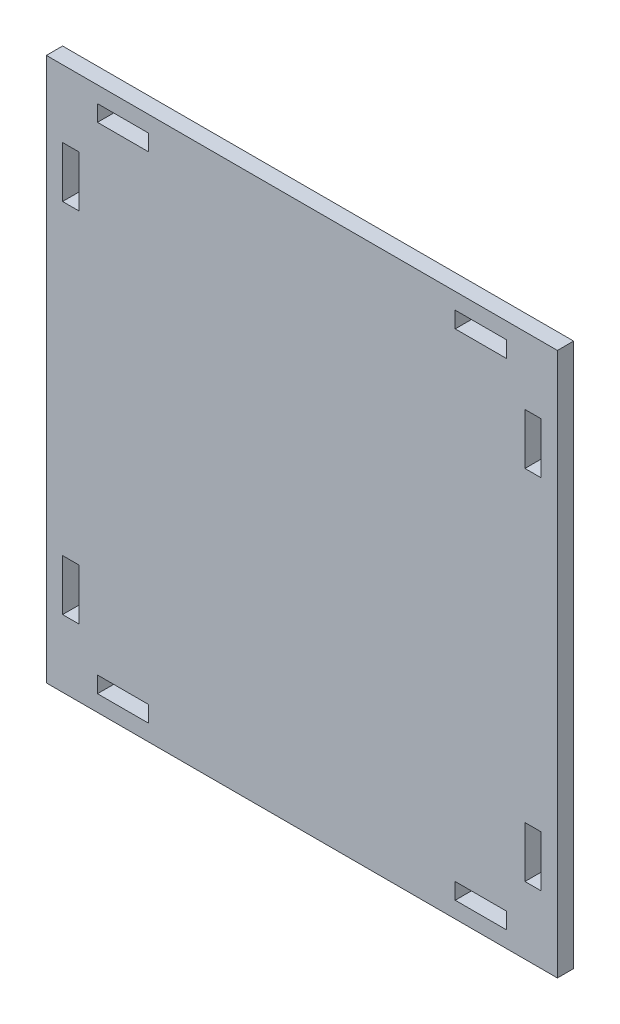
ISO-10303-21;
HEADER;
FILE_DESCRIPTION(('STEP AP214'),'2;1');
FILE_NAME('part.step','',(''),(''),'','','');
FILE_SCHEMA(('AUTOMOTIVE_DESIGN { 1 0 10303 214 1 1 1 1 }'));
ENDSEC;
DATA;
#1=APPLICATION_CONTEXT('core data for automotive mechanical design processes');
#2=APPLICATION_PROTOCOL_DEFINITION('international standard','automotive_design',2000,#1);
#3=PRODUCT_CONTEXT('',#1,'mechanical');
#4=PRODUCT('Part','Part','',(#3));
#5=PRODUCT_RELATED_PRODUCT_CATEGORY('part','',(#4));
#6=PRODUCT_DEFINITION_FORMATION('','',#4);
#7=PRODUCT_DEFINITION_CONTEXT('part definition',#1,'design');
#8=PRODUCT_DEFINITION('design','',#6,#7);
#9=PRODUCT_DEFINITION_SHAPE('','',#8);
#10=(LENGTH_UNIT() NAMED_UNIT(*) SI_UNIT(.MILLI.,.METRE.));
#11=(NAMED_UNIT(*) PLANE_ANGLE_UNIT() SI_UNIT($,.RADIAN.));
#12=(NAMED_UNIT(*) SI_UNIT($,.STERADIAN.) SOLID_ANGLE_UNIT());
#13=UNCERTAINTY_MEASURE_WITH_UNIT(LENGTH_MEASURE(1.E-05),#10,'distance_accuracy_value','');
#14=(GEOMETRIC_REPRESENTATION_CONTEXT(3) GLOBAL_UNCERTAINTY_ASSIGNED_CONTEXT((#13)) GLOBAL_UNIT_ASSIGNED_CONTEXT((#10,
#11,#12)) REPRESENTATION_CONTEXT('',''));
#15=CARTESIAN_POINT('',(0.,0.,0.));
#16=DIRECTION('',(0.,0.,1.));
#17=DIRECTION('',(1.,0.,0.));
#18=AXIS2_PLACEMENT_3D('',#15,#16,#17);
#19=CARTESIAN_POINT('',(0.,0.,3.175));
#20=DIRECTION('',(0.,0.,-1.));
#21=DIRECTION('',(-1.,0.,0.));
#22=AXIS2_PLACEMENT_3D('',#19,#20,#21);
#23=PLANE('',#22);
#24=DIRECTION('',(1.,0.,0.));
#25=VECTOR('',#24,1.);
#26=CARTESIAN_POINT('',(10.,3.175,3.175));
#27=LINE('',#26,#25);
#28=CARTESIAN_POINT('',(10.,3.175,3.175));
#29=VERTEX_POINT('',#28);
#30=CARTESIAN_POINT('',(20.,3.175,3.175));
#31=VERTEX_POINT('',#30);
#32=EDGE_CURVE('E302',#29,#31,#27,.T.);
#33=ORIENTED_EDGE('',*,*,#32,.F.);
#34=DIRECTION('',(0.,-1.,0.));
#35=VECTOR('',#34,1.);
#36=CARTESIAN_POINT('',(10.,3.175,3.175));
#37=LINE('',#36,#35);
#38=CARTESIAN_POINT('',(10.,6.34999999999999,3.175));
#39=VERTEX_POINT('',#38);
#40=EDGE_CURVE('E310',#39,#29,#37,.T.);
#41=ORIENTED_EDGE('',*,*,#40,.F.);
#42=DIRECTION('',(-1.,0.,0.));
#43=VECTOR('',#42,1.);
#44=CARTESIAN_POINT('',(10.,6.34999999999999,3.175));
#45=LINE('',#44,#43);
#46=CARTESIAN_POINT('',(20.,6.34999999999999,3.175));
#47=VERTEX_POINT('',#46);
#48=EDGE_CURVE('E307',#47,#39,#45,.T.);
#49=ORIENTED_EDGE('',*,*,#48,.F.);
#50=DIRECTION('',(0.,1.,0.));
#51=VECTOR('',#50,1.);
#52=CARTESIAN_POINT('',(20.,3.175,3.175));
#53=LINE('',#52,#51);
#54=EDGE_CURVE('E304',#31,#47,#53,.T.);
#55=ORIENTED_EDGE('',*,*,#54,.F.);
#56=EDGE_LOOP('',(#33,#41,#49,#55));
#57=FACE_BOUND('',#56,.T.);
#58=DIRECTION('',(0.,1.,0.));
#59=VECTOR('',#58,1.);
#60=CARTESIAN_POINT('',(96.825,23.175,3.175));
#61=LINE('',#60,#59);
#62=CARTESIAN_POINT('',(96.825,13.175,3.175));
#63=VERTEX_POINT('',#62);
#64=CARTESIAN_POINT('',(96.825,23.175,3.175));
#65=VERTEX_POINT('',#64);
#66=EDGE_CURVE('E364',#63,#65,#61,.T.);
#67=ORIENTED_EDGE('',*,*,#66,.F.);
#68=DIRECTION('',(1.,0.,0.));
#69=VECTOR('',#68,1.);
#70=CARTESIAN_POINT('',(96.825,13.175,3.175));
#71=LINE('',#70,#69);
#72=CARTESIAN_POINT('',(93.65,13.175,3.175));
#73=VERTEX_POINT('',#72);
#74=EDGE_CURVE('E372',#73,#63,#71,.T.);
#75=ORIENTED_EDGE('',*,*,#74,.F.);
#76=DIRECTION('',(0.,-1.,0.));
#77=VECTOR('',#76,1.);
#78=CARTESIAN_POINT('',(93.65,23.175,3.175));
#79=LINE('',#78,#77);
#80=CARTESIAN_POINT('',(93.65,23.175,3.175));
#81=VERTEX_POINT('',#80);
#82=EDGE_CURVE('E369',#81,#73,#79,.T.);
#83=ORIENTED_EDGE('',*,*,#82,.F.);
#84=DIRECTION('',(-1.,0.,0.));
#85=VECTOR('',#84,1.);
#86=CARTESIAN_POINT('',(96.825,23.175,3.175));
#87=LINE('',#86,#85);
#88=EDGE_CURVE('E366',#65,#81,#87,.T.);
#89=ORIENTED_EDGE('',*,*,#88,.F.);
#90=EDGE_LOOP('',(#67,#75,#83,#89));
#91=FACE_BOUND('',#90,.T.);
#92=DIRECTION('',(-1.,0.,0.));
#93=VECTOR('',#92,1.);
#94=CARTESIAN_POINT('',(90.,103.175,3.175));
#95=LINE('',#94,#93);
#96=CARTESIAN_POINT('',(90.,103.175,3.175));
#97=VERTEX_POINT('',#96);
#98=CARTESIAN_POINT('',(80.,103.175,3.175));
#99=VERTEX_POINT('',#98);
#100=EDGE_CURVE('E426',#97,#99,#95,.T.);
#101=ORIENTED_EDGE('',*,*,#100,.F.);
#102=DIRECTION('',(0.,1.,0.));
#103=VECTOR('',#102,1.);
#104=CARTESIAN_POINT('',(90.,103.175,3.175));
#105=LINE('',#104,#103);
#106=CARTESIAN_POINT('',(90.,100.,3.175));
#107=VERTEX_POINT('',#106);
#108=EDGE_CURVE('E434',#107,#97,#105,.T.);
#109=ORIENTED_EDGE('',*,*,#108,.F.);
#110=DIRECTION('',(1.,0.,0.));
#111=VECTOR('',#110,1.);
#112=CARTESIAN_POINT('',(90.,100.,3.175));
#113=LINE('',#112,#111);
#114=CARTESIAN_POINT('',(80.,100.,3.175));
#115=VERTEX_POINT('',#114);
#116=EDGE_CURVE('E431',#115,#107,#113,.T.);
#117=ORIENTED_EDGE('',*,*,#116,.F.);
#118=DIRECTION('',(0.,-1.,0.));
#119=VECTOR('',#118,1.);
#120=CARTESIAN_POINT('',(80.,103.175,3.175));
#121=LINE('',#120,#119);
#122=EDGE_CURVE('E428',#99,#115,#121,.T.);
#123=ORIENTED_EDGE('',*,*,#122,.F.);
#124=EDGE_LOOP('',(#101,#109,#117,#123));
#125=FACE_BOUND('',#124,.T.);
#126=DIRECTION('',(0.,-1.,0.));
#127=VECTOR('',#126,1.);
#128=CARTESIAN_POINT('',(3.175,83.175,3.175));
#129=LINE('',#128,#127);
#130=CARTESIAN_POINT('',(3.175,93.175,3.175));
#131=VERTEX_POINT('',#130);
#132=CARTESIAN_POINT('',(3.175,83.175,3.175));
#133=VERTEX_POINT('',#132);
#134=EDGE_CURVE('E488',#131,#133,#129,.T.);
#135=ORIENTED_EDGE('',*,*,#134,.F.);
#136=DIRECTION('',(-1.,0.,0.));
#137=VECTOR('',#136,1.);
#138=CARTESIAN_POINT('',(3.175,93.175,3.175));
#139=LINE('',#138,#137);
#140=CARTESIAN_POINT('',(6.35,93.175,3.175));
#141=VERTEX_POINT('',#140);
#142=EDGE_CURVE('E496',#141,#131,#139,.T.);
#143=ORIENTED_EDGE('',*,*,#142,.F.);
#144=DIRECTION('',(0.,1.,0.));
#145=VECTOR('',#144,1.);
#146=CARTESIAN_POINT('',(6.35,83.175,3.175));
#147=LINE('',#146,#145);
#148=CARTESIAN_POINT('',(6.35,83.175,3.175));
#149=VERTEX_POINT('',#148);
#150=EDGE_CURVE('E493',#149,#141,#147,.T.);
#151=ORIENTED_EDGE('',*,*,#150,.F.);
#152=DIRECTION('',(1.,0.,0.));
#153=VECTOR('',#152,1.);
#154=CARTESIAN_POINT('',(3.175,83.175,3.175));
#155=LINE('',#154,#153);
#156=EDGE_CURVE('E490',#133,#149,#155,.T.);
#157=ORIENTED_EDGE('',*,*,#156,.F.);
#158=EDGE_LOOP('',(#135,#143,#151,#157));
#159=FACE_BOUND('',#158,.T.);
#160=DIRECTION('',(0.,-1.,0.));
#161=VECTOR('',#160,1.);
#162=CARTESIAN_POINT('',(0.,0.,3.175));
#163=LINE('',#162,#161);
#164=CARTESIAN_POINT('',(0.,106.35,3.175));
#165=VERTEX_POINT('',#164);
#166=CARTESIAN_POINT('',(0.,0.,3.175));
#167=VERTEX_POINT('',#166);
#168=EDGE_CURVE('E519',#165,#167,#163,.T.);
#169=ORIENTED_EDGE('',*,*,#168,.T.);
#170=DIRECTION('',(1.,0.,0.));
#171=VECTOR('',#170,1.);
#172=CARTESIAN_POINT('',(0.,0.,3.175));
#173=LINE('',#172,#171);
#174=CARTESIAN_POINT('',(100.,0.,3.175));
#175=VERTEX_POINT('',#174);
#176=EDGE_CURVE('E522',#167,#175,#173,.T.);
#177=ORIENTED_EDGE('',*,*,#176,.T.);
#178=DIRECTION('',(0.,1.,0.));
#179=VECTOR('',#178,1.);
#180=CARTESIAN_POINT('',(100.,0.,3.175));
#181=LINE('',#180,#179);
#182=CARTESIAN_POINT('',(100.,106.35,3.175));
#183=VERTEX_POINT('',#182);
#184=EDGE_CURVE('E525',#175,#183,#181,.T.);
#185=ORIENTED_EDGE('',*,*,#184,.T.);
#186=DIRECTION('',(-1.,0.,0.));
#187=VECTOR('',#186,1.);
#188=CARTESIAN_POINT('',(0.,106.35,3.175));
#189=LINE('',#188,#187);
#190=EDGE_CURVE('E527',#183,#165,#189,.T.);
#191=ORIENTED_EDGE('',*,*,#190,.T.);
#192=EDGE_LOOP('',(#169,#177,#185,#191));
#193=FACE_BOUND('',#192,.T.);
#194=DIRECTION('',(0.,-1.,0.));
#195=VECTOR('',#194,1.);
#196=CARTESIAN_POINT('',(10.,103.175,3.175));
#197=LINE('',#196,#195);
#198=CARTESIAN_POINT('',(10.,103.175,3.175));
#199=VERTEX_POINT('',#198);
#200=CARTESIAN_POINT('',(10.,100.,3.175));
#201=VERTEX_POINT('',#200);
#202=EDGE_CURVE('E457',#199,#201,#197,.T.);
#203=ORIENTED_EDGE('',*,*,#202,.F.);
#204=DIRECTION('',(-1.,0.,0.));
#205=VECTOR('',#204,1.);
#206=CARTESIAN_POINT('',(10.,103.175,3.175));
#207=LINE('',#206,#205);
#208=CARTESIAN_POINT('',(20.,103.175,3.175));
#209=VERTEX_POINT('',#208);
#210=EDGE_CURVE('E465',#209,#199,#207,.T.);
#211=ORIENTED_EDGE('',*,*,#210,.F.);
#212=DIRECTION('',(0.,1.,0.));
#213=VECTOR('',#212,1.);
#214=CARTESIAN_POINT('',(20.,103.175,3.175));
#215=LINE('',#214,#213);
#216=CARTESIAN_POINT('',(20.,100.,3.175));
#217=VERTEX_POINT('',#216);
#218=EDGE_CURVE('E462',#217,#209,#215,.T.);
#219=ORIENTED_EDGE('',*,*,#218,.F.);
#220=DIRECTION('',(1.,0.,0.));
#221=VECTOR('',#220,1.);
#222=CARTESIAN_POINT('',(10.,100.,3.175));
#223=LINE('',#222,#221);
#224=EDGE_CURVE('E459',#201,#217,#223,.T.);
#225=ORIENTED_EDGE('',*,*,#224,.F.);
#226=EDGE_LOOP('',(#203,#211,#219,#225));
#227=FACE_BOUND('',#226,.T.);
#228=DIRECTION('',(1.,0.,0.));
#229=VECTOR('',#228,1.);
#230=CARTESIAN_POINT('',(96.825,83.175,3.175));
#231=LINE('',#230,#229);
#232=CARTESIAN_POINT('',(93.65,83.175,3.175));
#233=VERTEX_POINT('',#232);
#234=CARTESIAN_POINT('',(96.825,83.175,3.175));
#235=VERTEX_POINT('',#234);
#236=EDGE_CURVE('E395',#233,#235,#231,.T.);
#237=ORIENTED_EDGE('',*,*,#236,.F.);
#238=DIRECTION('',(0.,-1.,0.));
#239=VECTOR('',#238,1.);
#240=CARTESIAN_POINT('',(93.65,83.175,3.175));
#241=LINE('',#240,#239);
#242=CARTESIAN_POINT('',(93.65,93.175,3.175));
#243=VERTEX_POINT('',#242);
#244=EDGE_CURVE('E403',#243,#233,#241,.T.);
#245=ORIENTED_EDGE('',*,*,#244,.F.);
#246=DIRECTION('',(-1.,0.,0.));
#247=VECTOR('',#246,1.);
#248=CARTESIAN_POINT('',(96.825,93.175,3.175));
#249=LINE('',#248,#247);
#250=CARTESIAN_POINT('',(96.825,93.175,3.175));
#251=VERTEX_POINT('',#250);
#252=EDGE_CURVE('E400',#251,#243,#249,.T.);
#253=ORIENTED_EDGE('',*,*,#252,.F.);
#254=DIRECTION('',(0.,1.,0.));
#255=VECTOR('',#254,1.);
#256=CARTESIAN_POINT('',(96.825,83.175,3.175));
#257=LINE('',#256,#255);
#258=EDGE_CURVE('E397',#235,#251,#257,.T.);
#259=ORIENTED_EDGE('',*,*,#258,.F.);
#260=EDGE_LOOP('',(#237,#245,#253,#259));
#261=FACE_BOUND('',#260,.T.);
#262=DIRECTION('',(0.,1.,0.));
#263=VECTOR('',#262,1.);
#264=CARTESIAN_POINT('',(90.,3.175,3.175));
#265=LINE('',#264,#263);
#266=CARTESIAN_POINT('',(90.,3.175,3.175));
#267=VERTEX_POINT('',#266);
#268=CARTESIAN_POINT('',(90.,6.34999999999999,3.175));
#269=VERTEX_POINT('',#268);
#270=EDGE_CURVE('E333',#267,#269,#265,.T.);
#271=ORIENTED_EDGE('',*,*,#270,.F.);
#272=DIRECTION('',(1.,0.,0.));
#273=VECTOR('',#272,1.);
#274=CARTESIAN_POINT('',(90.,3.175,3.175));
#275=LINE('',#274,#273);
#276=CARTESIAN_POINT('',(80.,3.175,3.175));
#277=VERTEX_POINT('',#276);
#278=EDGE_CURVE('E341',#277,#267,#275,.T.);
#279=ORIENTED_EDGE('',*,*,#278,.F.);
#280=DIRECTION('',(0.,-1.,0.));
#281=VECTOR('',#280,1.);
#282=CARTESIAN_POINT('',(80.,3.175,3.175));
#283=LINE('',#282,#281);
#284=CARTESIAN_POINT('',(80.,6.34999999999999,3.175));
#285=VERTEX_POINT('',#284);
#286=EDGE_CURVE('E338',#285,#277,#283,.T.);
#287=ORIENTED_EDGE('',*,*,#286,.F.);
#288=DIRECTION('',(-1.,0.,0.));
#289=VECTOR('',#288,1.);
#290=CARTESIAN_POINT('',(90.,6.34999999999999,3.175));
#291=LINE('',#290,#289);
#292=EDGE_CURVE('E335',#269,#285,#291,.T.);
#293=ORIENTED_EDGE('',*,*,#292,.F.);
#294=EDGE_LOOP('',(#271,#279,#287,#293));
#295=FACE_BOUND('',#294,.T.);
#296=DIRECTION('',(-1.,0.,0.));
#297=VECTOR('',#296,1.);
#298=CARTESIAN_POINT('',(3.175,23.175,3.175));
#299=LINE('',#298,#297);
#300=CARTESIAN_POINT('',(6.35,23.175,3.175));
#301=VERTEX_POINT('',#300);
#302=CARTESIAN_POINT('',(3.175,23.175,3.175));
#303=VERTEX_POINT('',#302);
#304=EDGE_CURVE('E266',#301,#303,#299,.T.);
#305=ORIENTED_EDGE('',*,*,#304,.F.);
#306=DIRECTION('',(0.,1.,0.));
#307=VECTOR('',#306,1.);
#308=CARTESIAN_POINT('',(6.35,23.175,3.175));
#309=LINE('',#308,#307);
#310=CARTESIAN_POINT('',(6.35,13.175,3.175));
#311=VERTEX_POINT('',#310);
#312=EDGE_CURVE('E288',#311,#301,#309,.T.);
#313=ORIENTED_EDGE('',*,*,#312,.F.);
#314=DIRECTION('',(1.,0.,0.));
#315=VECTOR('',#314,1.);
#316=CARTESIAN_POINT('',(3.175,13.175,3.175));
#317=LINE('',#316,#315);
#318=CARTESIAN_POINT('',(3.175,13.175,3.175));
#319=VERTEX_POINT('',#318);
#320=EDGE_CURVE('E286',#319,#311,#317,.T.);
#321=ORIENTED_EDGE('',*,*,#320,.F.);
#322=DIRECTION('',(0.,-1.,0.));
#323=VECTOR('',#322,1.);
#324=CARTESIAN_POINT('',(3.175,23.175,3.175));
#325=LINE('',#324,#323);
#326=EDGE_CURVE('E274',#303,#319,#325,.T.);
#327=ORIENTED_EDGE('',*,*,#326,.F.);
#328=EDGE_LOOP('',(#305,#313,#321,#327));
#329=FACE_BOUND('',#328,.T.);
#330=ADVANCED_FACE('F33',(#57,#91,#125,#159,#193,#227,#261,#295,#329),#23,.F.);
#331=CARTESIAN_POINT('',(0.,0.,0.));
#332=DIRECTION('',(0.,0.,-1.));
#333=DIRECTION('',(-1.,0.,0.));
#334=AXIS2_PLACEMENT_3D('',#331,#332,#333);
#335=PLANE('',#334);
#336=DIRECTION('',(0.,-1.,0.));
#337=VECTOR('',#336,1.);
#338=CARTESIAN_POINT('',(0.,0.,0.));
#339=LINE('',#338,#337);
#340=CARTESIAN_POINT('',(0.,106.35,0.));
#341=VERTEX_POINT('',#340);
#342=CARTESIAN_POINT('',(0.,0.,0.));
#343=VERTEX_POINT('',#342);
#344=EDGE_CURVE('E518',#341,#343,#339,.T.);
#345=ORIENTED_EDGE('',*,*,#344,.F.);
#346=DIRECTION('',(-1.,0.,0.));
#347=VECTOR('',#346,1.);
#348=CARTESIAN_POINT('',(0.,106.35,0.));
#349=LINE('',#348,#347);
#350=CARTESIAN_POINT('',(100.,106.35,0.));
#351=VERTEX_POINT('',#350);
#352=EDGE_CURVE('E523',#351,#341,#349,.T.);
#353=ORIENTED_EDGE('',*,*,#352,.F.);
#354=DIRECTION('',(0.,1.,0.));
#355=VECTOR('',#354,1.);
#356=CARTESIAN_POINT('',(100.,0.,0.));
#357=LINE('',#356,#355);
#358=CARTESIAN_POINT('',(100.,0.,0.));
#359=VERTEX_POINT('',#358);
#360=EDGE_CURVE('E534',#359,#351,#357,.T.);
#361=ORIENTED_EDGE('',*,*,#360,.F.);
#362=DIRECTION('',(1.,0.,0.));
#363=VECTOR('',#362,1.);
#364=CARTESIAN_POINT('',(0.,0.,0.));
#365=LINE('',#364,#363);
#366=EDGE_CURVE('E532',#343,#359,#365,.T.);
#367=ORIENTED_EDGE('',*,*,#366,.F.);
#368=EDGE_LOOP('',(#345,#353,#361,#367));
#369=FACE_BOUND('',#368,.T.);
#370=DIRECTION('',(-1.,0.,0.));
#371=VECTOR('',#370,1.);
#372=CARTESIAN_POINT('',(3.175,93.175,0.));
#373=LINE('',#372,#371);
#374=CARTESIAN_POINT('',(6.35,93.175,0.));
#375=VERTEX_POINT('',#374);
#376=CARTESIAN_POINT('',(3.175,93.175,0.));
#377=VERTEX_POINT('',#376);
#378=EDGE_CURVE('E491',#375,#377,#373,.T.);
#379=ORIENTED_EDGE('',*,*,#378,.T.);
#380=DIRECTION('',(0.,-1.,0.));
#381=VECTOR('',#380,1.);
#382=CARTESIAN_POINT('',(3.175,83.175,0.));
#383=LINE('',#382,#381);
#384=CARTESIAN_POINT('',(3.175,83.175,0.));
#385=VERTEX_POINT('',#384);
#386=EDGE_CURVE('E487',#377,#385,#383,.T.);
#387=ORIENTED_EDGE('',*,*,#386,.T.);
#388=DIRECTION('',(1.,0.,0.));
#389=VECTOR('',#388,1.);
#390=CARTESIAN_POINT('',(3.175,83.175,0.));
#391=LINE('',#390,#389);
#392=CARTESIAN_POINT('',(6.35,83.175,0.));
#393=VERTEX_POINT('',#392);
#394=EDGE_CURVE('E501',#385,#393,#391,.T.);
#395=ORIENTED_EDGE('',*,*,#394,.T.);
#396=DIRECTION('',(0.,1.,0.));
#397=VECTOR('',#396,1.);
#398=CARTESIAN_POINT('',(6.35,83.175,0.));
#399=LINE('',#398,#397);
#400=EDGE_CURVE('E504',#393,#375,#399,.T.);
#401=ORIENTED_EDGE('',*,*,#400,.T.);
#402=EDGE_LOOP('',(#379,#387,#395,#401));
#403=FACE_BOUND('',#402,.T.);
#404=DIRECTION('',(-1.,0.,0.));
#405=VECTOR('',#404,1.);
#406=CARTESIAN_POINT('',(10.,103.175,0.));
#407=LINE('',#406,#405);
#408=CARTESIAN_POINT('',(20.,103.175,0.));
#409=VERTEX_POINT('',#408);
#410=CARTESIAN_POINT('',(10.,103.175,0.));
#411=VERTEX_POINT('',#410);
#412=EDGE_CURVE('E460',#409,#411,#407,.T.);
#413=ORIENTED_EDGE('',*,*,#412,.T.);
#414=DIRECTION('',(0.,-1.,0.));
#415=VECTOR('',#414,1.);
#416=CARTESIAN_POINT('',(10.,103.175,0.));
#417=LINE('',#416,#415);
#418=CARTESIAN_POINT('',(10.,100.,0.));
#419=VERTEX_POINT('',#418);
#420=EDGE_CURVE('E456',#411,#419,#417,.T.);
#421=ORIENTED_EDGE('',*,*,#420,.T.);
#422=DIRECTION('',(1.,0.,0.));
#423=VECTOR('',#422,1.);
#424=CARTESIAN_POINT('',(10.,100.,0.));
#425=LINE('',#424,#423);
#426=CARTESIAN_POINT('',(20.,100.,0.));
#427=VERTEX_POINT('',#426);
#428=EDGE_CURVE('E470',#419,#427,#425,.T.);
#429=ORIENTED_EDGE('',*,*,#428,.T.);
#430=DIRECTION('',(0.,1.,0.));
#431=VECTOR('',#430,1.);
#432=CARTESIAN_POINT('',(20.,103.175,0.));
#433=LINE('',#432,#431);
#434=EDGE_CURVE('E473',#427,#409,#433,.T.);
#435=ORIENTED_EDGE('',*,*,#434,.T.);
#436=EDGE_LOOP('',(#413,#421,#429,#435));
#437=FACE_BOUND('',#436,.T.);
#438=DIRECTION('',(0.,1.,0.));
#439=VECTOR('',#438,1.);
#440=CARTESIAN_POINT('',(90.,103.175,0.));
#441=LINE('',#440,#439);
#442=CARTESIAN_POINT('',(90.,100.,0.));
#443=VERTEX_POINT('',#442);
#444=CARTESIAN_POINT('',(90.,103.175,0.));
#445=VERTEX_POINT('',#444);
#446=EDGE_CURVE('E429',#443,#445,#441,.T.);
#447=ORIENTED_EDGE('',*,*,#446,.T.);
#448=DIRECTION('',(-1.,0.,0.));
#449=VECTOR('',#448,1.);
#450=CARTESIAN_POINT('',(90.,103.175,0.));
#451=LINE('',#450,#449);
#452=CARTESIAN_POINT('',(80.,103.175,0.));
#453=VERTEX_POINT('',#452);
#454=EDGE_CURVE('E425',#445,#453,#451,.T.);
#455=ORIENTED_EDGE('',*,*,#454,.T.);
#456=DIRECTION('',(0.,-1.,0.));
#457=VECTOR('',#456,1.);
#458=CARTESIAN_POINT('',(80.,103.175,0.));
#459=LINE('',#458,#457);
#460=CARTESIAN_POINT('',(80.,100.,0.));
#461=VERTEX_POINT('',#460);
#462=EDGE_CURVE('E439',#453,#461,#459,.T.);
#463=ORIENTED_EDGE('',*,*,#462,.T.);
#464=DIRECTION('',(1.,0.,0.));
#465=VECTOR('',#464,1.);
#466=CARTESIAN_POINT('',(90.,100.,0.));
#467=LINE('',#466,#465);
#468=EDGE_CURVE('E442',#461,#443,#467,.T.);
#469=ORIENTED_EDGE('',*,*,#468,.T.);
#470=EDGE_LOOP('',(#447,#455,#463,#469));
#471=FACE_BOUND('',#470,.T.);
#472=DIRECTION('',(0.,-1.,0.));
#473=VECTOR('',#472,1.);
#474=CARTESIAN_POINT('',(93.65,83.175,0.));
#475=LINE('',#474,#473);
#476=CARTESIAN_POINT('',(93.65,93.175,0.));
#477=VERTEX_POINT('',#476);
#478=CARTESIAN_POINT('',(93.65,83.175,0.));
#479=VERTEX_POINT('',#478);
#480=EDGE_CURVE('E398',#477,#479,#475,.T.);
#481=ORIENTED_EDGE('',*,*,#480,.T.);
#482=DIRECTION('',(1.,0.,0.));
#483=VECTOR('',#482,1.);
#484=CARTESIAN_POINT('',(96.825,83.175,0.));
#485=LINE('',#484,#483);
#486=CARTESIAN_POINT('',(96.825,83.175,0.));
#487=VERTEX_POINT('',#486);
#488=EDGE_CURVE('E394',#479,#487,#485,.T.);
#489=ORIENTED_EDGE('',*,*,#488,.T.);
#490=DIRECTION('',(0.,1.,0.));
#491=VECTOR('',#490,1.);
#492=CARTESIAN_POINT('',(96.825,83.175,0.));
#493=LINE('',#492,#491);
#494=CARTESIAN_POINT('',(96.825,93.175,0.));
#495=VERTEX_POINT('',#494);
#496=EDGE_CURVE('E408',#487,#495,#493,.T.);
#497=ORIENTED_EDGE('',*,*,#496,.T.);
#498=DIRECTION('',(-1.,0.,0.));
#499=VECTOR('',#498,1.);
#500=CARTESIAN_POINT('',(96.825,93.175,0.));
#501=LINE('',#500,#499);
#502=EDGE_CURVE('E411',#495,#477,#501,.T.);
#503=ORIENTED_EDGE('',*,*,#502,.T.);
#504=EDGE_LOOP('',(#481,#489,#497,#503));
#505=FACE_BOUND('',#504,.T.);
#506=DIRECTION('',(1.,0.,0.));
#507=VECTOR('',#506,1.);
#508=CARTESIAN_POINT('',(96.825,13.175,0.));
#509=LINE('',#508,#507);
#510=CARTESIAN_POINT('',(93.65,13.175,0.));
#511=VERTEX_POINT('',#510);
#512=CARTESIAN_POINT('',(96.825,13.175,0.));
#513=VERTEX_POINT('',#512);
#514=EDGE_CURVE('E367',#511,#513,#509,.T.);
#515=ORIENTED_EDGE('',*,*,#514,.T.);
#516=DIRECTION('',(0.,1.,0.));
#517=VECTOR('',#516,1.);
#518=CARTESIAN_POINT('',(96.825,23.175,0.));
#519=LINE('',#518,#517);
#520=CARTESIAN_POINT('',(96.825,23.175,0.));
#521=VERTEX_POINT('',#520);
#522=EDGE_CURVE('E363',#513,#521,#519,.T.);
#523=ORIENTED_EDGE('',*,*,#522,.T.);
#524=DIRECTION('',(-1.,0.,0.));
#525=VECTOR('',#524,1.);
#526=CARTESIAN_POINT('',(96.825,23.175,0.));
#527=LINE('',#526,#525);
#528=CARTESIAN_POINT('',(93.65,23.175,0.));
#529=VERTEX_POINT('',#528);
#530=EDGE_CURVE('E377',#521,#529,#527,.T.);
#531=ORIENTED_EDGE('',*,*,#530,.T.);
#532=DIRECTION('',(0.,-1.,0.));
#533=VECTOR('',#532,1.);
#534=CARTESIAN_POINT('',(93.65,23.175,0.));
#535=LINE('',#534,#533);
#536=EDGE_CURVE('E380',#529,#511,#535,.T.);
#537=ORIENTED_EDGE('',*,*,#536,.T.);
#538=EDGE_LOOP('',(#515,#523,#531,#537));
#539=FACE_BOUND('',#538,.T.);
#540=DIRECTION('',(1.,0.,0.));
#541=VECTOR('',#540,1.);
#542=CARTESIAN_POINT('',(90.,3.175,0.));
#543=LINE('',#542,#541);
#544=CARTESIAN_POINT('',(80.,3.175,0.));
#545=VERTEX_POINT('',#544);
#546=CARTESIAN_POINT('',(90.,3.175,0.));
#547=VERTEX_POINT('',#546);
#548=EDGE_CURVE('E336',#545,#547,#543,.T.);
#549=ORIENTED_EDGE('',*,*,#548,.T.);
#550=DIRECTION('',(0.,1.,0.));
#551=VECTOR('',#550,1.);
#552=CARTESIAN_POINT('',(90.,3.175,0.));
#553=LINE('',#552,#551);
#554=CARTESIAN_POINT('',(90.,6.34999999999999,0.));
#555=VERTEX_POINT('',#554);
#556=EDGE_CURVE('E332',#547,#555,#553,.T.);
#557=ORIENTED_EDGE('',*,*,#556,.T.);
#558=DIRECTION('',(-1.,0.,0.));
#559=VECTOR('',#558,1.);
#560=CARTESIAN_POINT('',(90.,6.34999999999999,0.));
#561=LINE('',#560,#559);
#562=CARTESIAN_POINT('',(80.,6.34999999999999,0.));
#563=VERTEX_POINT('',#562);
#564=EDGE_CURVE('E346',#555,#563,#561,.T.);
#565=ORIENTED_EDGE('',*,*,#564,.T.);
#566=DIRECTION('',(0.,-1.,0.));
#567=VECTOR('',#566,1.);
#568=CARTESIAN_POINT('',(80.,3.175,0.));
#569=LINE('',#568,#567);
#570=EDGE_CURVE('E349',#563,#545,#569,.T.);
#571=ORIENTED_EDGE('',*,*,#570,.T.);
#572=EDGE_LOOP('',(#549,#557,#565,#571));
#573=FACE_BOUND('',#572,.T.);
#574=DIRECTION('',(0.,-1.,0.));
#575=VECTOR('',#574,1.);
#576=CARTESIAN_POINT('',(10.,3.175,0.));
#577=LINE('',#576,#575);
#578=CARTESIAN_POINT('',(10.,6.34999999999999,0.));
#579=VERTEX_POINT('',#578);
#580=CARTESIAN_POINT('',(10.,3.175,0.));
#581=VERTEX_POINT('',#580);
#582=EDGE_CURVE('E305',#579,#581,#577,.T.);
#583=ORIENTED_EDGE('',*,*,#582,.T.);
#584=DIRECTION('',(1.,0.,0.));
#585=VECTOR('',#584,1.);
#586=CARTESIAN_POINT('',(10.,3.175,0.));
#587=LINE('',#586,#585);
#588=CARTESIAN_POINT('',(20.,3.175,0.));
#589=VERTEX_POINT('',#588);
#590=EDGE_CURVE('E282',#581,#589,#587,.T.);
#591=ORIENTED_EDGE('',*,*,#590,.T.);
#592=DIRECTION('',(0.,1.,0.));
#593=VECTOR('',#592,1.);
#594=CARTESIAN_POINT('',(20.,3.175,0.));
#595=LINE('',#594,#593);
#596=CARTESIAN_POINT('',(20.,6.34999999999999,0.));
#597=VERTEX_POINT('',#596);
#598=EDGE_CURVE('E315',#589,#597,#595,.T.);
#599=ORIENTED_EDGE('',*,*,#598,.T.);
#600=DIRECTION('',(-1.,0.,0.));
#601=VECTOR('',#600,1.);
#602=CARTESIAN_POINT('',(10.,6.34999999999999,0.));
#603=LINE('',#602,#601);
#604=EDGE_CURVE('E318',#597,#579,#603,.T.);
#605=ORIENTED_EDGE('',*,*,#604,.T.);
#606=EDGE_LOOP('',(#583,#591,#599,#605));
#607=FACE_BOUND('',#606,.T.);
#608=DIRECTION('',(0.,1.,0.));
#609=VECTOR('',#608,1.);
#610=CARTESIAN_POINT('',(6.35,23.175,0.));
#611=LINE('',#610,#609);
#612=CARTESIAN_POINT('',(6.35,13.175,0.));
#613=VERTEX_POINT('',#612);
#614=CARTESIAN_POINT('',(6.35,23.175,0.));
#615=VERTEX_POINT('',#614);
#616=EDGE_CURVE('E275',#613,#615,#611,.T.);
#617=ORIENTED_EDGE('',*,*,#616,.T.);
#618=DIRECTION('',(-1.,0.,0.));
#619=VECTOR('',#618,1.);
#620=CARTESIAN_POINT('',(3.175,23.175,0.));
#621=LINE('',#620,#619);
#622=CARTESIAN_POINT('',(3.175,23.175,0.));
#623=VERTEX_POINT('',#622);
#624=EDGE_CURVE('E56',#615,#623,#621,.T.);
#625=ORIENTED_EDGE('',*,*,#624,.T.);
#626=DIRECTION('',(0.,-1.,0.));
#627=VECTOR('',#626,1.);
#628=CARTESIAN_POINT('',(3.175,23.175,0.));
#629=LINE('',#628,#627);
#630=CARTESIAN_POINT('',(3.175,13.175,0.));
#631=VERTEX_POINT('',#630);
#632=EDGE_CURVE('E281',#623,#631,#629,.T.);
#633=ORIENTED_EDGE('',*,*,#632,.T.);
#634=DIRECTION('',(1.,0.,0.));
#635=VECTOR('',#634,1.);
#636=CARTESIAN_POINT('',(3.175,13.175,0.));
#637=LINE('',#636,#635);
#638=EDGE_CURVE('E294',#631,#613,#637,.T.);
#639=ORIENTED_EDGE('',*,*,#638,.T.);
#640=EDGE_LOOP('',(#617,#625,#633,#639));
#641=FACE_BOUND('',#640,.T.);
#642=ADVANCED_FACE('F552',(#369,#403,#437,#471,#505,#539,#573,#607,#641),#335,.T.);
#643=CARTESIAN_POINT('',(0.,0.,3.175));
#644=DIRECTION('',(1.,0.,0.));
#645=DIRECTION('',(0.,0.,-1.));
#646=AXIS2_PLACEMENT_3D('',#643,#644,#645);
#647=PLANE('',#646);
#648=ORIENTED_EDGE('',*,*,#344,.T.);
#649=DIRECTION('',(0.,0.,-1.));
#650=VECTOR('',#649,1.);
#651=CARTESIAN_POINT('',(0.,0.,3.175));
#652=LINE('',#651,#650);
#653=EDGE_CURVE('E11',#167,#343,#652,.T.);
#654=ORIENTED_EDGE('',*,*,#653,.F.);
#655=ORIENTED_EDGE('',*,*,#168,.F.);
#656=DIRECTION('',(0.,0.,-1.));
#657=VECTOR('',#656,1.);
#658=CARTESIAN_POINT('',(0.,106.35,3.175));
#659=LINE('',#658,#657);
#660=EDGE_CURVE('E529',#165,#341,#659,.T.);
#661=ORIENTED_EDGE('',*,*,#660,.T.);
#662=EDGE_LOOP('',(#648,#654,#655,#661));
#663=FACE_BOUND('',#662,.T.);
#664=ADVANCED_FACE('F35',(#663),#647,.F.);
#665=CARTESIAN_POINT('',(0.,0.,3.175));
#666=DIRECTION('',(0.,1.,0.));
#667=DIRECTION('',(0.,0.,1.));
#668=AXIS2_PLACEMENT_3D('',#665,#666,#667);
#669=PLANE('',#668);
#670=ORIENTED_EDGE('',*,*,#366,.T.);
#671=DIRECTION('',(0.,0.,-1.));
#672=VECTOR('',#671,1.);
#673=CARTESIAN_POINT('',(100.,0.,3.175));
#674=LINE('',#673,#672);
#675=EDGE_CURVE('E41',#175,#359,#674,.T.);
#676=ORIENTED_EDGE('',*,*,#675,.F.);
#677=ORIENTED_EDGE('',*,*,#176,.F.);
#678=ORIENTED_EDGE('',*,*,#653,.T.);
#679=EDGE_LOOP('',(#670,#676,#677,#678));
#680=FACE_BOUND('',#679,.T.);
#681=ADVANCED_FACE('F563',(#680),#669,.F.);
#682=CARTESIAN_POINT('',(100.,0.,3.175));
#683=DIRECTION('',(-1.,0.,0.));
#684=DIRECTION('',(0.,0.,1.));
#685=AXIS2_PLACEMENT_3D('',#682,#683,#684);
#686=PLANE('',#685);
#687=ORIENTED_EDGE('',*,*,#360,.T.);
#688=DIRECTION('',(0.,0.,-1.));
#689=VECTOR('',#688,1.);
#690=CARTESIAN_POINT('',(100.,106.35,3.175));
#691=LINE('',#690,#689);
#692=EDGE_CURVE('E539',#183,#351,#691,.T.);
#693=ORIENTED_EDGE('',*,*,#692,.F.);
#694=ORIENTED_EDGE('',*,*,#184,.F.);
#695=ORIENTED_EDGE('',*,*,#675,.T.);
#696=EDGE_LOOP('',(#687,#693,#694,#695));
#697=FACE_BOUND('',#696,.T.);
#698=ADVANCED_FACE('F546',(#697),#686,.F.);
#699=CARTESIAN_POINT('',(0.,106.35,3.175));
#700=DIRECTION('',(0.,-1.,0.));
#701=DIRECTION('',(0.,0.,-1.));
#702=AXIS2_PLACEMENT_3D('',#699,#700,#701);
#703=PLANE('',#702);
#704=ORIENTED_EDGE('',*,*,#352,.T.);
#705=ORIENTED_EDGE('',*,*,#660,.F.);
#706=ORIENTED_EDGE('',*,*,#190,.F.);
#707=ORIENTED_EDGE('',*,*,#692,.T.);
#708=EDGE_LOOP('',(#704,#705,#706,#707));
#709=FACE_BOUND('',#708,.T.);
#710=ADVANCED_FACE('F556',(#709),#703,.F.);
#711=CARTESIAN_POINT('',(3.175,83.175,3.175));
#712=DIRECTION('',(1.,0.,0.));
#713=DIRECTION('',(0.,0.,-1.));
#714=AXIS2_PLACEMENT_3D('',#711,#712,#713);
#715=PLANE('',#714);
#716=ORIENTED_EDGE('',*,*,#386,.F.);
#717=DIRECTION('',(0.,0.,-1.));
#718=VECTOR('',#717,1.);
#719=CARTESIAN_POINT('',(3.175,93.175,3.175));
#720=LINE('',#719,#718);
#721=EDGE_CURVE('E498',#131,#377,#720,.T.);
#722=ORIENTED_EDGE('',*,*,#721,.F.);
#723=ORIENTED_EDGE('',*,*,#134,.T.);
#724=DIRECTION('',(0.,0.,-1.));
#725=VECTOR('',#724,1.);
#726=CARTESIAN_POINT('',(3.175,83.175,3.175));
#727=LINE('',#726,#725);
#728=EDGE_CURVE('E515',#133,#385,#727,.T.);
#729=ORIENTED_EDGE('',*,*,#728,.T.);
#730=EDGE_LOOP('',(#716,#722,#723,#729));
#731=FACE_BOUND('',#730,.T.);
#732=ADVANCED_FACE('F580',(#731),#715,.T.);
#733=CARTESIAN_POINT('',(3.175,83.175,3.175));
#734=DIRECTION('',(0.,1.,0.));
#735=DIRECTION('',(0.,0.,1.));
#736=AXIS2_PLACEMENT_3D('',#733,#734,#735);
#737=PLANE('',#736);
#738=ORIENTED_EDGE('',*,*,#394,.F.);
#739=ORIENTED_EDGE('',*,*,#728,.F.);
#740=ORIENTED_EDGE('',*,*,#156,.T.);
#741=DIRECTION('',(0.,0.,-1.));
#742=VECTOR('',#741,1.);
#743=CARTESIAN_POINT('',(6.35,83.175,3.175));
#744=LINE('',#743,#742);
#745=EDGE_CURVE('E513',#149,#393,#744,.T.);
#746=ORIENTED_EDGE('',*,*,#745,.T.);
#747=EDGE_LOOP('',(#738,#739,#740,#746));
#748=FACE_BOUND('',#747,.T.);
#749=ADVANCED_FACE('F587',(#748),#737,.T.);
#750=CARTESIAN_POINT('',(6.35,83.175,3.175));
#751=DIRECTION('',(-1.,0.,0.));
#752=DIRECTION('',(0.,0.,1.));
#753=AXIS2_PLACEMENT_3D('',#750,#751,#752);
#754=PLANE('',#753);
#755=ORIENTED_EDGE('',*,*,#400,.F.);
#756=ORIENTED_EDGE('',*,*,#745,.F.);
#757=ORIENTED_EDGE('',*,*,#150,.T.);
#758=DIRECTION('',(0.,0.,-1.));
#759=VECTOR('',#758,1.);
#760=CARTESIAN_POINT('',(6.35,93.175,3.175));
#761=LINE('',#760,#759);
#762=EDGE_CURVE('E511',#141,#375,#761,.T.);
#763=ORIENTED_EDGE('',*,*,#762,.T.);
#764=EDGE_LOOP('',(#755,#756,#757,#763));
#765=FACE_BOUND('',#764,.T.);
#766=ADVANCED_FACE('F592',(#765),#754,.T.);
#767=CARTESIAN_POINT('',(3.175,93.175,3.175));
#768=DIRECTION('',(0.,-1.,0.));
#769=DIRECTION('',(0.,0.,-1.));
#770=AXIS2_PLACEMENT_3D('',#767,#768,#769);
#771=PLANE('',#770);
#772=ORIENTED_EDGE('',*,*,#378,.F.);
#773=ORIENTED_EDGE('',*,*,#762,.F.);
#774=ORIENTED_EDGE('',*,*,#142,.T.);
#775=ORIENTED_EDGE('',*,*,#721,.T.);
#776=EDGE_LOOP('',(#772,#773,#774,#775));
#777=FACE_BOUND('',#776,.T.);
#778=ADVANCED_FACE('F599',(#777),#771,.T.);
#779=CARTESIAN_POINT('',(10.,103.175,3.175));
#780=DIRECTION('',(1.,0.,0.));
#781=DIRECTION('',(0.,1.,0.));
#782=AXIS2_PLACEMENT_3D('',#779,#780,#781);
#783=PLANE('',#782);
#784=ORIENTED_EDGE('',*,*,#420,.F.);
#785=DIRECTION('',(0.,0.,-1.));
#786=VECTOR('',#785,1.);
#787=CARTESIAN_POINT('',(10.,103.175,3.175));
#788=LINE('',#787,#786);
#789=EDGE_CURVE('E467',#199,#411,#788,.T.);
#790=ORIENTED_EDGE('',*,*,#789,.F.);
#791=ORIENTED_EDGE('',*,*,#202,.T.);
#792=DIRECTION('',(0.,0.,-1.));
#793=VECTOR('',#792,1.);
#794=CARTESIAN_POINT('',(10.,100.,3.175));
#795=LINE('',#794,#793);
#796=EDGE_CURVE('E484',#201,#419,#795,.T.);
#797=ORIENTED_EDGE('',*,*,#796,.T.);
#798=EDGE_LOOP('',(#784,#790,#791,#797));
#799=FACE_BOUND('',#798,.T.);
#800=ADVANCED_FACE('F613',(#799),#783,.T.);
#801=CARTESIAN_POINT('',(10.,100.,3.175));
#802=DIRECTION('',(0.,1.,0.));
#803=DIRECTION('',(0.,0.,1.));
#804=AXIS2_PLACEMENT_3D('',#801,#802,#803);
#805=PLANE('',#804);
#806=ORIENTED_EDGE('',*,*,#428,.F.);
#807=ORIENTED_EDGE('',*,*,#796,.F.);
#808=ORIENTED_EDGE('',*,*,#224,.T.);
#809=DIRECTION('',(0.,0.,-1.));
#810=VECTOR('',#809,1.);
#811=CARTESIAN_POINT('',(20.,100.,3.175));
#812=LINE('',#811,#810);
#813=EDGE_CURVE('E482',#217,#427,#812,.T.);
#814=ORIENTED_EDGE('',*,*,#813,.T.);
#815=EDGE_LOOP('',(#806,#807,#808,#814));
#816=FACE_BOUND('',#815,.T.);
#817=ADVANCED_FACE('F618',(#816),#805,.T.);
#818=CARTESIAN_POINT('',(20.,103.175,3.175));
#819=DIRECTION('',(-1.,0.,0.));
#820=DIRECTION('',(0.,0.,1.));
#821=AXIS2_PLACEMENT_3D('',#818,#819,#820);
#822=PLANE('',#821);
#823=ORIENTED_EDGE('',*,*,#434,.F.);
#824=ORIENTED_EDGE('',*,*,#813,.F.);
#825=ORIENTED_EDGE('',*,*,#218,.T.);
#826=DIRECTION('',(0.,0.,-1.));
#827=VECTOR('',#826,1.);
#828=CARTESIAN_POINT('',(20.,103.175,3.175));
#829=LINE('',#828,#827);
#830=EDGE_CURVE('E480',#209,#409,#829,.T.);
#831=ORIENTED_EDGE('',*,*,#830,.T.);
#832=EDGE_LOOP('',(#823,#824,#825,#831));
#833=FACE_BOUND('',#832,.T.);
#834=ADVANCED_FACE('F622',(#833),#822,.T.);
#835=CARTESIAN_POINT('',(10.,103.175,3.175));
#836=DIRECTION('',(0.,-1.,0.));
#837=DIRECTION('',(0.,0.,-1.));
#838=AXIS2_PLACEMENT_3D('',#835,#836,#837);
#839=PLANE('',#838);
#840=ORIENTED_EDGE('',*,*,#412,.F.);
#841=ORIENTED_EDGE('',*,*,#830,.F.);
#842=ORIENTED_EDGE('',*,*,#210,.T.);
#843=ORIENTED_EDGE('',*,*,#789,.T.);
#844=EDGE_LOOP('',(#840,#841,#842,#843));
#845=FACE_BOUND('',#844,.T.);
#846=ADVANCED_FACE('F626',(#845),#839,.T.);
#847=CARTESIAN_POINT('',(90.,103.175,3.175));
#848=DIRECTION('',(0.,-1.,0.));
#849=DIRECTION('',(0.,0.,-1.));
#850=AXIS2_PLACEMENT_3D('',#847,#848,#849);
#851=PLANE('',#850);
#852=ORIENTED_EDGE('',*,*,#454,.F.);
#853=DIRECTION('',(0.,0.,-1.));
#854=VECTOR('',#853,1.);
#855=CARTESIAN_POINT('',(90.,103.175,3.175));
#856=LINE('',#855,#854);
#857=EDGE_CURVE('E436',#97,#445,#856,.T.);
#858=ORIENTED_EDGE('',*,*,#857,.F.);
#859=ORIENTED_EDGE('',*,*,#100,.T.);
#860=DIRECTION('',(0.,0.,-1.));
#861=VECTOR('',#860,1.);
#862=CARTESIAN_POINT('',(80.,103.175,3.175));
#863=LINE('',#862,#861);
#864=EDGE_CURVE('E453',#99,#453,#863,.T.);
#865=ORIENTED_EDGE('',*,*,#864,.T.);
#866=EDGE_LOOP('',(#852,#858,#859,#865));
#867=FACE_BOUND('',#866,.T.);
#868=ADVANCED_FACE('F630',(#867),#851,.T.);
#869=CARTESIAN_POINT('',(80.,103.175,3.175));
#870=DIRECTION('',(1.,0.,0.));
#871=DIRECTION('',(0.,0.,-1.));
#872=AXIS2_PLACEMENT_3D('',#869,#870,#871);
#873=PLANE('',#872);
#874=ORIENTED_EDGE('',*,*,#462,.F.);
#875=ORIENTED_EDGE('',*,*,#864,.F.);
#876=ORIENTED_EDGE('',*,*,#122,.T.);
#877=DIRECTION('',(0.,0.,-1.));
#878=VECTOR('',#877,1.);
#879=CARTESIAN_POINT('',(80.,100.,3.175));
#880=LINE('',#879,#878);
#881=EDGE_CURVE('E451',#115,#461,#880,.T.);
#882=ORIENTED_EDGE('',*,*,#881,.T.);
#883=EDGE_LOOP('',(#874,#875,#876,#882));
#884=FACE_BOUND('',#883,.T.);
#885=ADVANCED_FACE('F634',(#884),#873,.T.);
#886=CARTESIAN_POINT('',(90.,100.,3.175));
#887=DIRECTION('',(0.,1.,0.));
#888=DIRECTION('',(0.,0.,1.));
#889=AXIS2_PLACEMENT_3D('',#886,#887,#888);
#890=PLANE('',#889);
#891=ORIENTED_EDGE('',*,*,#468,.F.);
#892=ORIENTED_EDGE('',*,*,#881,.F.);
#893=ORIENTED_EDGE('',*,*,#116,.T.);
#894=DIRECTION('',(0.,0.,-1.));
#895=VECTOR('',#894,1.);
#896=CARTESIAN_POINT('',(90.,100.,3.175));
#897=LINE('',#896,#895);
#898=EDGE_CURVE('E449',#107,#443,#897,.T.);
#899=ORIENTED_EDGE('',*,*,#898,.T.);
#900=EDGE_LOOP('',(#891,#892,#893,#899));
#901=FACE_BOUND('',#900,.T.);
#902=ADVANCED_FACE('F638',(#901),#890,.T.);
#903=CARTESIAN_POINT('',(90.,103.175,3.175));
#904=DIRECTION('',(-1.,0.,0.));
#905=DIRECTION('',(0.,0.,1.));
#906=AXIS2_PLACEMENT_3D('',#903,#904,#905);
#907=PLANE('',#906);
#908=ORIENTED_EDGE('',*,*,#446,.F.);
#909=ORIENTED_EDGE('',*,*,#898,.F.);
#910=ORIENTED_EDGE('',*,*,#108,.T.);
#911=ORIENTED_EDGE('',*,*,#857,.T.);
#912=EDGE_LOOP('',(#908,#909,#910,#911));
#913=FACE_BOUND('',#912,.T.);
#914=ADVANCED_FACE('F642',(#913),#907,.T.);
#915=CARTESIAN_POINT('',(96.825,83.175,3.175));
#916=DIRECTION('',(0.,1.,0.));
#917=DIRECTION('',(0.,0.,1.));
#918=AXIS2_PLACEMENT_3D('',#915,#916,#917);
#919=PLANE('',#918);
#920=ORIENTED_EDGE('',*,*,#488,.F.);
#921=DIRECTION('',(0.,0.,-1.));
#922=VECTOR('',#921,1.);
#923=CARTESIAN_POINT('',(93.65,83.175,3.175));
#924=LINE('',#923,#922);
#925=EDGE_CURVE('E405',#233,#479,#924,.T.);
#926=ORIENTED_EDGE('',*,*,#925,.F.);
#927=ORIENTED_EDGE('',*,*,#236,.T.);
#928=DIRECTION('',(0.,0.,-1.));
#929=VECTOR('',#928,1.);
#930=CARTESIAN_POINT('',(96.825,83.175,3.175));
#931=LINE('',#930,#929);
#932=EDGE_CURVE('E422',#235,#487,#931,.T.);
#933=ORIENTED_EDGE('',*,*,#932,.T.);
#934=EDGE_LOOP('',(#920,#926,#927,#933));
#935=FACE_BOUND('',#934,.T.);
#936=ADVANCED_FACE('F646',(#935),#919,.T.);
#937=CARTESIAN_POINT('',(96.825,83.175,3.175));
#938=DIRECTION('',(-1.,0.,0.));
#939=DIRECTION('',(0.,0.,1.));
#940=AXIS2_PLACEMENT_3D('',#937,#938,#939);
#941=PLANE('',#940);
#942=ORIENTED_EDGE('',*,*,#496,.F.);
#943=ORIENTED_EDGE('',*,*,#932,.F.);
#944=ORIENTED_EDGE('',*,*,#258,.T.);
#945=DIRECTION('',(0.,0.,-1.));
#946=VECTOR('',#945,1.);
#947=CARTESIAN_POINT('',(96.825,93.175,3.175));
#948=LINE('',#947,#946);
#949=EDGE_CURVE('E420',#251,#495,#948,.T.);
#950=ORIENTED_EDGE('',*,*,#949,.T.);
#951=EDGE_LOOP('',(#942,#943,#944,#950));
#952=FACE_BOUND('',#951,.T.);
#953=ADVANCED_FACE('F650',(#952),#941,.T.);
#954=CARTESIAN_POINT('',(96.825,93.175,3.175));
#955=DIRECTION('',(0.,-1.,0.));
#956=DIRECTION('',(0.,0.,-1.));
#957=AXIS2_PLACEMENT_3D('',#954,#955,#956);
#958=PLANE('',#957);
#959=ORIENTED_EDGE('',*,*,#502,.F.);
#960=ORIENTED_EDGE('',*,*,#949,.F.);
#961=ORIENTED_EDGE('',*,*,#252,.T.);
#962=DIRECTION('',(0.,0.,-1.));
#963=VECTOR('',#962,1.);
#964=CARTESIAN_POINT('',(93.65,93.175,3.175));
#965=LINE('',#964,#963);
#966=EDGE_CURVE('E418',#243,#477,#965,.T.);
#967=ORIENTED_EDGE('',*,*,#966,.T.);
#968=EDGE_LOOP('',(#959,#960,#961,#967));
#969=FACE_BOUND('',#968,.T.);
#970=ADVANCED_FACE('F654',(#969),#958,.T.);
#971=CARTESIAN_POINT('',(93.65,83.175,3.175));
#972=DIRECTION('',(1.,0.,0.));
#973=DIRECTION('',(0.,0.,-1.));
#974=AXIS2_PLACEMENT_3D('',#971,#972,#973);
#975=PLANE('',#974);
#976=ORIENTED_EDGE('',*,*,#480,.F.);
#977=ORIENTED_EDGE('',*,*,#966,.F.);
#978=ORIENTED_EDGE('',*,*,#244,.T.);
#979=ORIENTED_EDGE('',*,*,#925,.T.);
#980=EDGE_LOOP('',(#976,#977,#978,#979));
#981=FACE_BOUND('',#980,.T.);
#982=ADVANCED_FACE('F658',(#981),#975,.T.);
#983=CARTESIAN_POINT('',(96.825,23.175,3.175));
#984=DIRECTION('',(-1.,0.,0.));
#985=DIRECTION('',(0.,0.,1.));
#986=AXIS2_PLACEMENT_3D('',#983,#984,#985);
#987=PLANE('',#986);
#988=ORIENTED_EDGE('',*,*,#522,.F.);
#989=DIRECTION('',(0.,0.,-1.));
#990=VECTOR('',#989,1.);
#991=CARTESIAN_POINT('',(96.825,13.175,3.175));
#992=LINE('',#991,#990);
#993=EDGE_CURVE('E374',#63,#513,#992,.T.);
#994=ORIENTED_EDGE('',*,*,#993,.F.);
#995=ORIENTED_EDGE('',*,*,#66,.T.);
#996=DIRECTION('',(0.,0.,-1.));
#997=VECTOR('',#996,1.);
#998=CARTESIAN_POINT('',(96.825,23.175,3.175));
#999=LINE('',#998,#997);
#1000=EDGE_CURVE('E391',#65,#521,#999,.T.);
#1001=ORIENTED_EDGE('',*,*,#1000,.T.);
#1002=EDGE_LOOP('',(#988,#994,#995,#1001));
#1003=FACE_BOUND('',#1002,.T.);
#1004=ADVANCED_FACE('F662',(#1003),#987,.T.);
#1005=CARTESIAN_POINT('',(96.825,23.175,3.175));
#1006=DIRECTION('',(0.,-1.,0.));
#1007=DIRECTION('',(0.,0.,-1.));
#1008=AXIS2_PLACEMENT_3D('',#1005,#1006,#1007);
#1009=PLANE('',#1008);
#1010=ORIENTED_EDGE('',*,*,#530,.F.);
#1011=ORIENTED_EDGE('',*,*,#1000,.F.);
#1012=ORIENTED_EDGE('',*,*,#88,.T.);
#1013=DIRECTION('',(0.,0.,-1.));
#1014=VECTOR('',#1013,1.);
#1015=CARTESIAN_POINT('',(93.65,23.175,3.175));
#1016=LINE('',#1015,#1014);
#1017=EDGE_CURVE('E389',#81,#529,#1016,.T.);
#1018=ORIENTED_EDGE('',*,*,#1017,.T.);
#1019=EDGE_LOOP('',(#1010,#1011,#1012,#1018));
#1020=FACE_BOUND('',#1019,.T.);
#1021=ADVANCED_FACE('F666',(#1020),#1009,.T.);
#1022=CARTESIAN_POINT('',(93.65,23.175,3.175));
#1023=DIRECTION('',(1.,0.,0.));
#1024=DIRECTION('',(0.,0.,-1.));
#1025=AXIS2_PLACEMENT_3D('',#1022,#1023,#1024);
#1026=PLANE('',#1025);
#1027=ORIENTED_EDGE('',*,*,#536,.F.);
#1028=ORIENTED_EDGE('',*,*,#1017,.F.);
#1029=ORIENTED_EDGE('',*,*,#82,.T.);
#1030=DIRECTION('',(0.,0.,-1.));
#1031=VECTOR('',#1030,1.);
#1032=CARTESIAN_POINT('',(93.65,13.175,3.175));
#1033=LINE('',#1032,#1031);
#1034=EDGE_CURVE('E387',#73,#511,#1033,.T.);
#1035=ORIENTED_EDGE('',*,*,#1034,.T.);
#1036=EDGE_LOOP('',(#1027,#1028,#1029,#1035));
#1037=FACE_BOUND('',#1036,.T.);
#1038=ADVANCED_FACE('F670',(#1037),#1026,.T.);
#1039=CARTESIAN_POINT('',(96.825,13.175,3.175));
#1040=DIRECTION('',(0.,1.,0.));
#1041=DIRECTION('',(0.,0.,1.));
#1042=AXIS2_PLACEMENT_3D('',#1039,#1040,#1041);
#1043=PLANE('',#1042);
#1044=ORIENTED_EDGE('',*,*,#514,.F.);
#1045=ORIENTED_EDGE('',*,*,#1034,.F.);
#1046=ORIENTED_EDGE('',*,*,#74,.T.);
#1047=ORIENTED_EDGE('',*,*,#993,.T.);
#1048=EDGE_LOOP('',(#1044,#1045,#1046,#1047));
#1049=FACE_BOUND('',#1048,.T.);
#1050=ADVANCED_FACE('F674',(#1049),#1043,.T.);
#1051=CARTESIAN_POINT('',(90.,3.175,3.175));
#1052=DIRECTION('',(-1.,0.,0.));
#1053=DIRECTION('',(0.,0.,1.));
#1054=AXIS2_PLACEMENT_3D('',#1051,#1052,#1053);
#1055=PLANE('',#1054);
#1056=ORIENTED_EDGE('',*,*,#556,.F.);
#1057=DIRECTION('',(0.,0.,-1.));
#1058=VECTOR('',#1057,1.);
#1059=CARTESIAN_POINT('',(90.,3.175,3.175));
#1060=LINE('',#1059,#1058);
#1061=EDGE_CURVE('E343',#267,#547,#1060,.T.);
#1062=ORIENTED_EDGE('',*,*,#1061,.F.);
#1063=ORIENTED_EDGE('',*,*,#270,.T.);
#1064=DIRECTION('',(0.,0.,-1.));
#1065=VECTOR('',#1064,1.);
#1066=CARTESIAN_POINT('',(90.,6.34999999999999,3.175));
#1067=LINE('',#1066,#1065);
#1068=EDGE_CURVE('E360',#269,#555,#1067,.T.);
#1069=ORIENTED_EDGE('',*,*,#1068,.T.);
#1070=EDGE_LOOP('',(#1056,#1062,#1063,#1069));
#1071=FACE_BOUND('',#1070,.T.);
#1072=ADVANCED_FACE('F678',(#1071),#1055,.T.);
#1073=CARTESIAN_POINT('',(90.,6.34999999999999,3.175));
#1074=DIRECTION('',(0.,-1.,0.));
#1075=DIRECTION('',(0.,0.,-1.));
#1076=AXIS2_PLACEMENT_3D('',#1073,#1074,#1075);
#1077=PLANE('',#1076);
#1078=ORIENTED_EDGE('',*,*,#564,.F.);
#1079=ORIENTED_EDGE('',*,*,#1068,.F.);
#1080=ORIENTED_EDGE('',*,*,#292,.T.);
#1081=DIRECTION('',(0.,0.,-1.));
#1082=VECTOR('',#1081,1.);
#1083=CARTESIAN_POINT('',(80.,6.34999999999999,3.175));
#1084=LINE('',#1083,#1082);
#1085=EDGE_CURVE('E358',#285,#563,#1084,.T.);
#1086=ORIENTED_EDGE('',*,*,#1085,.T.);
#1087=EDGE_LOOP('',(#1078,#1079,#1080,#1086));
#1088=FACE_BOUND('',#1087,.T.);
#1089=ADVANCED_FACE('F682',(#1088),#1077,.T.);
#1090=CARTESIAN_POINT('',(80.,3.175,3.175));
#1091=DIRECTION('',(1.,0.,0.));
#1092=DIRECTION('',(0.,0.,-1.));
#1093=AXIS2_PLACEMENT_3D('',#1090,#1091,#1092);
#1094=PLANE('',#1093);
#1095=ORIENTED_EDGE('',*,*,#570,.F.);
#1096=ORIENTED_EDGE('',*,*,#1085,.F.);
#1097=ORIENTED_EDGE('',*,*,#286,.T.);
#1098=DIRECTION('',(0.,0.,-1.));
#1099=VECTOR('',#1098,1.);
#1100=CARTESIAN_POINT('',(80.,3.175,3.175));
#1101=LINE('',#1100,#1099);
#1102=EDGE_CURVE('E356',#277,#545,#1101,.T.);
#1103=ORIENTED_EDGE('',*,*,#1102,.T.);
#1104=EDGE_LOOP('',(#1095,#1096,#1097,#1103));
#1105=FACE_BOUND('',#1104,.T.);
#1106=ADVANCED_FACE('F686',(#1105),#1094,.T.);
#1107=CARTESIAN_POINT('',(90.,3.175,3.175));
#1108=DIRECTION('',(0.,1.,0.));
#1109=DIRECTION('',(0.,0.,1.));
#1110=AXIS2_PLACEMENT_3D('',#1107,#1108,#1109);
#1111=PLANE('',#1110);
#1112=ORIENTED_EDGE('',*,*,#548,.F.);
#1113=ORIENTED_EDGE('',*,*,#1102,.F.);
#1114=ORIENTED_EDGE('',*,*,#278,.T.);
#1115=ORIENTED_EDGE('',*,*,#1061,.T.);
#1116=EDGE_LOOP('',(#1112,#1113,#1114,#1115));
#1117=FACE_BOUND('',#1116,.T.);
#1118=ADVANCED_FACE('F690',(#1117),#1111,.T.);
#1119=CARTESIAN_POINT('',(10.,3.175,3.175));
#1120=DIRECTION('',(0.,1.,0.));
#1121=DIRECTION('',(0.,0.,1.));
#1122=AXIS2_PLACEMENT_3D('',#1119,#1120,#1121);
#1123=PLANE('',#1122);
#1124=ORIENTED_EDGE('',*,*,#590,.F.);
#1125=DIRECTION('',(0.,0.,-1.));
#1126=VECTOR('',#1125,1.);
#1127=CARTESIAN_POINT('',(10.,3.175,3.175));
#1128=LINE('',#1127,#1126);
#1129=EDGE_CURVE('E312',#29,#581,#1128,.T.);
#1130=ORIENTED_EDGE('',*,*,#1129,.F.);
#1131=ORIENTED_EDGE('',*,*,#32,.T.);
#1132=DIRECTION('',(0.,0.,-1.));
#1133=VECTOR('',#1132,1.);
#1134=CARTESIAN_POINT('',(20.,3.175,3.175));
#1135=LINE('',#1134,#1133);
#1136=EDGE_CURVE('E329',#31,#589,#1135,.T.);
#1137=ORIENTED_EDGE('',*,*,#1136,.T.);
#1138=EDGE_LOOP('',(#1124,#1130,#1131,#1137));
#1139=FACE_BOUND('',#1138,.T.);
#1140=ADVANCED_FACE('F694',(#1139),#1123,.T.);
#1141=CARTESIAN_POINT('',(20.,3.175,3.175));
#1142=DIRECTION('',(-1.,0.,0.));
#1143=DIRECTION('',(0.,0.,1.));
#1144=AXIS2_PLACEMENT_3D('',#1141,#1142,#1143);
#1145=PLANE('',#1144);
#1146=ORIENTED_EDGE('',*,*,#598,.F.);
#1147=ORIENTED_EDGE('',*,*,#1136,.F.);
#1148=ORIENTED_EDGE('',*,*,#54,.T.);
#1149=DIRECTION('',(0.,0.,-1.));
#1150=VECTOR('',#1149,1.);
#1151=CARTESIAN_POINT('',(20.,6.34999999999999,3.175));
#1152=LINE('',#1151,#1150);
#1153=EDGE_CURVE('E327',#47,#597,#1152,.T.);
#1154=ORIENTED_EDGE('',*,*,#1153,.T.);
#1155=EDGE_LOOP('',(#1146,#1147,#1148,#1154));
#1156=FACE_BOUND('',#1155,.T.);
#1157=ADVANCED_FACE('F698',(#1156),#1145,.T.);
#1158=CARTESIAN_POINT('',(10.,6.34999999999999,3.175));
#1159=DIRECTION('',(0.,-1.,0.));
#1160=DIRECTION('',(0.,0.,-1.));
#1161=AXIS2_PLACEMENT_3D('',#1158,#1159,#1160);
#1162=PLANE('',#1161);
#1163=ORIENTED_EDGE('',*,*,#604,.F.);
#1164=ORIENTED_EDGE('',*,*,#1153,.F.);
#1165=ORIENTED_EDGE('',*,*,#48,.T.);
#1166=DIRECTION('',(0.,0.,-1.));
#1167=VECTOR('',#1166,1.);
#1168=CARTESIAN_POINT('',(10.,6.34999999999999,3.175));
#1169=LINE('',#1168,#1167);
#1170=EDGE_CURVE('E325',#39,#579,#1169,.T.);
#1171=ORIENTED_EDGE('',*,*,#1170,.T.);
#1172=EDGE_LOOP('',(#1163,#1164,#1165,#1171));
#1173=FACE_BOUND('',#1172,.T.);
#1174=ADVANCED_FACE('F702',(#1173),#1162,.T.);
#1175=CARTESIAN_POINT('',(10.,3.175,3.175));
#1176=DIRECTION('',(1.,0.,0.));
#1177=DIRECTION('',(0.,0.,-1.));
#1178=AXIS2_PLACEMENT_3D('',#1175,#1176,#1177);
#1179=PLANE('',#1178);
#1180=ORIENTED_EDGE('',*,*,#582,.F.);
#1181=ORIENTED_EDGE('',*,*,#1170,.F.);
#1182=ORIENTED_EDGE('',*,*,#40,.T.);
#1183=ORIENTED_EDGE('',*,*,#1129,.T.);
#1184=EDGE_LOOP('',(#1180,#1181,#1182,#1183));
#1185=FACE_BOUND('',#1184,.T.);
#1186=ADVANCED_FACE('F706',(#1185),#1179,.T.);
#1187=CARTESIAN_POINT('',(3.175,23.175,3.175));
#1188=DIRECTION('',(0.,-1.,0.));
#1189=DIRECTION('',(0.,0.,-1.));
#1190=AXIS2_PLACEMENT_3D('',#1187,#1188,#1189);
#1191=PLANE('',#1190);
#1192=ORIENTED_EDGE('',*,*,#624,.F.);
#1193=DIRECTION('',(0.,0.,-1.));
#1194=VECTOR('',#1193,1.);
#1195=CARTESIAN_POINT('',(6.35,23.175,3.175));
#1196=LINE('',#1195,#1194);
#1197=EDGE_CURVE('E270',#301,#615,#1196,.T.);
#1198=ORIENTED_EDGE('',*,*,#1197,.F.);
#1199=ORIENTED_EDGE('',*,*,#304,.T.);
#1200=DIRECTION('',(0.,0.,-1.));
#1201=VECTOR('',#1200,1.);
#1202=CARTESIAN_POINT('',(3.175,23.175,3.175));
#1203=LINE('',#1202,#1201);
#1204=EDGE_CURVE('E269',#303,#623,#1203,.T.);
#1205=ORIENTED_EDGE('',*,*,#1204,.T.);
#1206=EDGE_LOOP('',(#1192,#1198,#1199,#1205));
#1207=FACE_BOUND('',#1206,.T.);
#1208=ADVANCED_FACE('F268',(#1207),#1191,.T.);
#1209=CARTESIAN_POINT('',(3.175,23.175,3.175));
#1210=DIRECTION('',(1.,0.,0.));
#1211=DIRECTION('',(0.,0.,-1.));
#1212=AXIS2_PLACEMENT_3D('',#1209,#1210,#1211);
#1213=PLANE('',#1212);
#1214=ORIENTED_EDGE('',*,*,#632,.F.);
#1215=ORIENTED_EDGE('',*,*,#1204,.F.);
#1216=ORIENTED_EDGE('',*,*,#326,.T.);
#1217=DIRECTION('',(0.,0.,-1.));
#1218=VECTOR('',#1217,1.);
#1219=CARTESIAN_POINT('',(3.175,13.175,3.175));
#1220=LINE('',#1219,#1218);
#1221=EDGE_CURVE('E283',#319,#631,#1220,.T.);
#1222=ORIENTED_EDGE('',*,*,#1221,.T.);
#1223=EDGE_LOOP('',(#1214,#1215,#1216,#1222));
#1224=FACE_BOUND('',#1223,.T.);
#1225=ADVANCED_FACE('F278',(#1224),#1213,.T.);
#1226=CARTESIAN_POINT('',(3.175,13.175,3.175));
#1227=DIRECTION('',(0.,1.,0.));
#1228=DIRECTION('',(0.,0.,1.));
#1229=AXIS2_PLACEMENT_3D('',#1226,#1227,#1228);
#1230=PLANE('',#1229);
#1231=ORIENTED_EDGE('',*,*,#638,.F.);
#1232=ORIENTED_EDGE('',*,*,#1221,.F.);
#1233=ORIENTED_EDGE('',*,*,#320,.T.);
#1234=DIRECTION('',(0.,0.,-1.));
#1235=VECTOR('',#1234,1.);
#1236=CARTESIAN_POINT('',(6.35,13.175,3.175));
#1237=LINE('',#1236,#1235);
#1238=EDGE_CURVE('E48',#311,#613,#1237,.T.);
#1239=ORIENTED_EDGE('',*,*,#1238,.T.);
#1240=EDGE_LOOP('',(#1231,#1232,#1233,#1239));
#1241=FACE_BOUND('',#1240,.T.);
#1242=ADVANCED_FACE('F715',(#1241),#1230,.T.);
#1243=CARTESIAN_POINT('',(6.35,23.175,3.175));
#1244=DIRECTION('',(-1.,0.,0.));
#1245=DIRECTION('',(0.,0.,1.));
#1246=AXIS2_PLACEMENT_3D('',#1243,#1244,#1245);
#1247=PLANE('',#1246);
#1248=ORIENTED_EDGE('',*,*,#616,.F.);
#1249=ORIENTED_EDGE('',*,*,#1238,.F.);
#1250=ORIENTED_EDGE('',*,*,#312,.T.);
#1251=ORIENTED_EDGE('',*,*,#1197,.T.);
#1252=EDGE_LOOP('',(#1248,#1249,#1250,#1251));
#1253=FACE_BOUND('',#1252,.T.);
#1254=ADVANCED_FACE('F718',(#1253),#1247,.T.);
#1255=CLOSED_SHELL('',(#330,#642,#664,#681,#698,#710,#732,#749,#766,#778,#800,#817,#834,#846,
#868,#885,#902,#914,#936,#953,#970,#982,#1004,#1021,#1038,#1050,#1072,#1089,#1106,#1118,#1140,
#1157,#1174,#1186,#1208,#1225,#1242,#1254));
#1256=MANIFOLD_SOLID_BREP('B2',#1255);
#1257=ADVANCED_BREP_SHAPE_REPRESENTATION('',(#18,#1256),#14);
#1258=SHAPE_DEFINITION_REPRESENTATION(#9,#1257);
ENDSEC;
END-ISO-10303-21;
